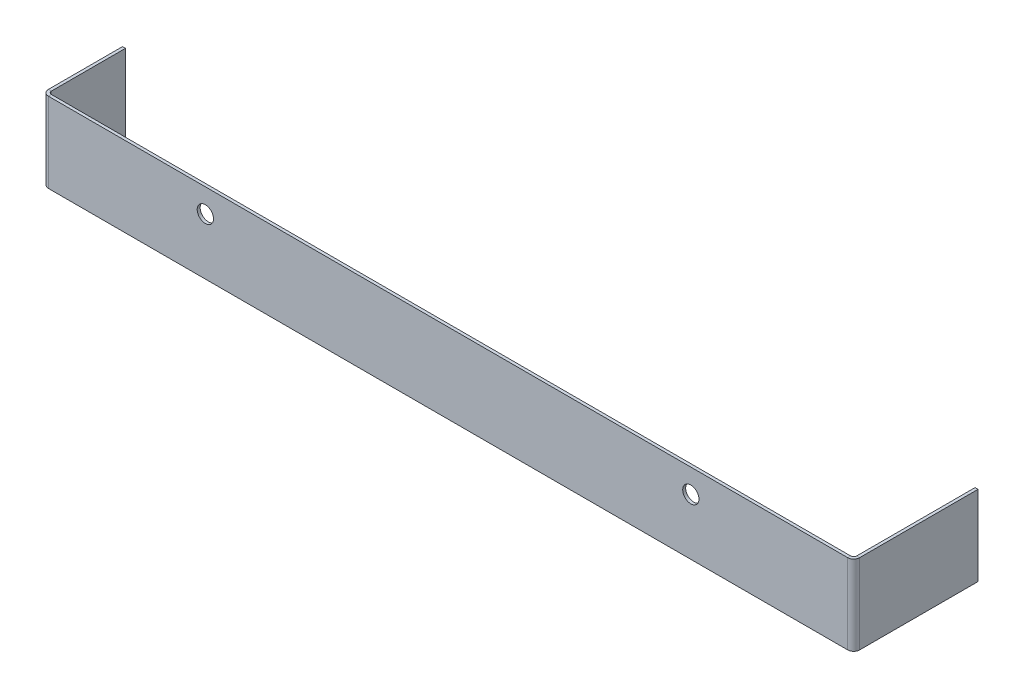
ISO-10303-21;
HEADER;
FILE_DESCRIPTION(('STEP AP214'),'2;1');
FILE_NAME('part.step','',(''),(''),'','','');
FILE_SCHEMA(('AUTOMOTIVE_DESIGN { 1 0 10303 214 1 1 1 1 }'));
ENDSEC;
DATA;
#1=APPLICATION_CONTEXT('core data for automotive mechanical design processes');
#2=APPLICATION_PROTOCOL_DEFINITION('international standard','automotive_design',2000,#1);
#3=PRODUCT_CONTEXT('',#1,'mechanical');
#4=PRODUCT('Part','Part','',(#3));
#5=PRODUCT_RELATED_PRODUCT_CATEGORY('part','',(#4));
#6=PRODUCT_DEFINITION_FORMATION('','',#4);
#7=PRODUCT_DEFINITION_CONTEXT('part definition',#1,'design');
#8=PRODUCT_DEFINITION('design','',#6,#7);
#9=PRODUCT_DEFINITION_SHAPE('','',#8);
#10=(LENGTH_UNIT() NAMED_UNIT(*) SI_UNIT(.MILLI.,.METRE.));
#11=(NAMED_UNIT(*) PLANE_ANGLE_UNIT() SI_UNIT($,.RADIAN.));
#12=(NAMED_UNIT(*) SI_UNIT($,.STERADIAN.) SOLID_ANGLE_UNIT());
#13=UNCERTAINTY_MEASURE_WITH_UNIT(LENGTH_MEASURE(1.E-05),#10,'distance_accuracy_value','');
#14=(GEOMETRIC_REPRESENTATION_CONTEXT(3) GLOBAL_UNCERTAINTY_ASSIGNED_CONTEXT((#13)) GLOBAL_UNIT_ASSIGNED_CONTEXT((#10,
#11,#12)) REPRESENTATION_CONTEXT('',''));
#15=CARTESIAN_POINT('',(0.,0.,0.));
#16=DIRECTION('',(0.,0.,1.));
#17=DIRECTION('',(1.,0.,0.));
#18=AXIS2_PLACEMENT_3D('',#15,#16,#17);
#19=CARTESIAN_POINT('',(-135.,-13.5,-1.));
#20=DIRECTION('',(0.,-1.,0.));
#21=DIRECTION('',(0.,0.,-1.));
#22=AXIS2_PLACEMENT_3D('',#19,#20,#21);
#23=PLANE('',#22);
#24=DIRECTION('',(1.,0.,0.));
#25=VECTOR('',#24,1.);
#26=CARTESIAN_POINT('',(-135.,-13.5,0.));
#27=LINE('',#26,#25);
#28=CARTESIAN_POINT('',(-135.,-13.5,0.));
#29=VERTEX_POINT('',#28);
#30=CARTESIAN_POINT('',(135.,-13.5,0.));
#31=VERTEX_POINT('',#30);
#32=EDGE_CURVE('E308',#29,#31,#27,.T.);
#33=ORIENTED_EDGE('',*,*,#32,.F.);
#34=DIRECTION('',(0.,0.,1.));
#35=VECTOR('',#34,1.);
#36=CARTESIAN_POINT('',(-135.,-13.5,-1.));
#37=LINE('',#36,#35);
#38=CARTESIAN_POINT('',(-135.,-13.5,-1.));
#39=VERTEX_POINT('',#38);
#40=EDGE_CURVE('E90',#39,#29,#37,.T.);
#41=ORIENTED_EDGE('',*,*,#40,.F.);
#42=DIRECTION('',(1.,0.,0.));
#43=VECTOR('',#42,1.);
#44=CARTESIAN_POINT('',(-135.,-13.5,-1.));
#45=LINE('',#44,#43);
#46=CARTESIAN_POINT('',(135.,-13.5,-1.));
#47=VERTEX_POINT('',#46);
#48=EDGE_CURVE('E315',#39,#47,#45,.T.);
#49=ORIENTED_EDGE('',*,*,#48,.T.);
#50=DIRECTION('',(0.,0.,1.));
#51=VECTOR('',#50,1.);
#52=CARTESIAN_POINT('',(135.,-13.5,-1.));
#53=LINE('',#52,#51);
#54=EDGE_CURVE('E13',#47,#31,#53,.T.);
#55=ORIENTED_EDGE('',*,*,#54,.T.);
#56=EDGE_LOOP('',(#33,#41,#49,#55));
#57=FACE_BOUND('',#56,.T.);
#58=ADVANCED_FACE('F80',(#57),#23,.T.);
#59=CARTESIAN_POINT('',(-135.,13.5,-1.));
#60=DIRECTION('',(0.,1.,0.));
#61=DIRECTION('',(0.,0.,1.));
#62=AXIS2_PLACEMENT_3D('',#59,#60,#61);
#63=PLANE('',#62);
#64=DIRECTION('',(-1.,0.,0.));
#65=VECTOR('',#64,1.);
#66=CARTESIAN_POINT('',(-135.,13.5,0.));
#67=LINE('',#66,#65);
#68=CARTESIAN_POINT('',(135.,13.5,0.));
#69=VERTEX_POINT('',#68);
#70=CARTESIAN_POINT('',(-135.,13.5,0.));
#71=VERTEX_POINT('',#70);
#72=EDGE_CURVE('E322',#69,#71,#67,.T.);
#73=ORIENTED_EDGE('',*,*,#72,.F.);
#74=DIRECTION('',(0.,0.,1.));
#75=VECTOR('',#74,1.);
#76=CARTESIAN_POINT('',(135.,13.5,-1.));
#77=LINE('',#76,#75);
#78=CARTESIAN_POINT('',(135.,13.5,-1.));
#79=VERTEX_POINT('',#78);
#80=EDGE_CURVE('E84',#79,#69,#77,.T.);
#81=ORIENTED_EDGE('',*,*,#80,.F.);
#82=DIRECTION('',(-1.,0.,0.));
#83=VECTOR('',#82,1.);
#84=CARTESIAN_POINT('',(-135.,13.5,-1.));
#85=LINE('',#84,#83);
#86=CARTESIAN_POINT('',(-135.,13.5,-1.));
#87=VERTEX_POINT('',#86);
#88=EDGE_CURVE('E307',#79,#87,#85,.T.);
#89=ORIENTED_EDGE('',*,*,#88,.T.);
#90=DIRECTION('',(0.,0.,1.));
#91=VECTOR('',#90,1.);
#92=CARTESIAN_POINT('',(-135.,13.5,-1.));
#93=LINE('',#92,#91);
#94=EDGE_CURVE('E332',#87,#71,#93,.T.);
#95=ORIENTED_EDGE('',*,*,#94,.T.);
#96=EDGE_LOOP('',(#73,#81,#89,#95));
#97=FACE_BOUND('',#96,.T.);
#98=ADVANCED_FACE('F82',(#97),#63,.T.);
#99=CARTESIAN_POINT('',(0.,0.,-1.));
#100=DIRECTION('',(0.,0.,-1.));
#101=DIRECTION('',(-1.,0.,0.));
#102=AXIS2_PLACEMENT_3D('',#99,#100,#101);
#103=PLANE('',#102);
#104=CARTESIAN_POINT('',(82.,5.50000000000072,-1.));
#105=DIRECTION('',(0.,0.,-1.));
#106=DIRECTION('',(-1.,0.,0.));
#107=AXIS2_PLACEMENT_3D('',#104,#105,#106);
#108=CIRCLE('',#107,2.75);
#109=CARTESIAN_POINT('',(79.25,5.50000000000072,-1.));
#110=VERTEX_POINT('',#109);
#111=EDGE_CURVE('E451',#110,#110,#108,.T.);
#112=ORIENTED_EDGE('',*,*,#111,.F.);
#113=EDGE_LOOP('',(#112));
#114=FACE_BOUND('',#113,.T.);
#115=CARTESIAN_POINT('',(-82.,5.50000000000072,-1.));
#116=DIRECTION('',(0.,0.,-1.));
#117=DIRECTION('',(-1.,0.,0.));
#118=AXIS2_PLACEMENT_3D('',#115,#116,#117);
#119=CIRCLE('',#118,2.75);
#120=CARTESIAN_POINT('',(-84.75,5.50000000000072,-1.));
#121=VERTEX_POINT('',#120);
#122=EDGE_CURVE('E238',#121,#121,#119,.T.);
#123=ORIENTED_EDGE('',*,*,#122,.F.);
#124=EDGE_LOOP('',(#123));
#125=FACE_BOUND('',#124,.T.);
#126=DIRECTION('',(0.,1.,0.));
#127=VECTOR('',#126,1.);
#128=CARTESIAN_POINT('',(135.,-13.5,-1.));
#129=LINE('',#128,#127);
#130=EDGE_CURVE('E304',#47,#79,#129,.T.);
#131=ORIENTED_EDGE('',*,*,#130,.F.);
#132=ORIENTED_EDGE('',*,*,#48,.F.);
#133=DIRECTION('',(0.,-1.,0.));
#134=VECTOR('',#133,1.);
#135=CARTESIAN_POINT('',(-135.,-13.5,-1.));
#136=LINE('',#135,#134);
#137=EDGE_CURVE('E312',#87,#39,#136,.T.);
#138=ORIENTED_EDGE('',*,*,#137,.F.);
#139=ORIENTED_EDGE('',*,*,#88,.F.);
#140=EDGE_LOOP('',(#131,#132,#138,#139));
#141=FACE_BOUND('',#140,.T.);
#142=ADVANCED_FACE('F355',(#114,#125,#141),#103,.T.);
#143=CARTESIAN_POINT('',(0.,0.,0.));
#144=DIRECTION('',(0.,0.,-1.));
#145=DIRECTION('',(-1.,0.,0.));
#146=AXIS2_PLACEMENT_3D('',#143,#144,#145);
#147=PLANE('',#146);
#148=CARTESIAN_POINT('',(82.,5.50000000000072,0.));
#149=DIRECTION('',(0.,0.,1.));
#150=DIRECTION('',(1.,0.,0.));
#151=AXIS2_PLACEMENT_3D('',#148,#149,#150);
#152=CIRCLE('',#151,2.75);
#153=CARTESIAN_POINT('',(84.75,5.50000000000072,0.));
#154=VERTEX_POINT('',#153);
#155=EDGE_CURVE('E454',#154,#154,#152,.T.);
#156=ORIENTED_EDGE('',*,*,#155,.F.);
#157=EDGE_LOOP('',(#156));
#158=FACE_BOUND('',#157,.T.);
#159=CARTESIAN_POINT('',(-82.,5.50000000000072,0.));
#160=DIRECTION('',(0.,0.,1.));
#161=DIRECTION('',(1.,0.,0.));
#162=AXIS2_PLACEMENT_3D('',#159,#160,#161);
#163=CIRCLE('',#162,2.75);
#164=CARTESIAN_POINT('',(-79.25,5.50000000000072,0.));
#165=VERTEX_POINT('',#164);
#166=EDGE_CURVE('E458',#165,#165,#163,.T.);
#167=ORIENTED_EDGE('',*,*,#166,.F.);
#168=EDGE_LOOP('',(#167));
#169=FACE_BOUND('',#168,.T.);
#170=DIRECTION('',(0.,1.,0.));
#171=VECTOR('',#170,1.);
#172=CARTESIAN_POINT('',(135.,-13.5,0.));
#173=LINE('',#172,#171);
#174=EDGE_CURVE('E292',#31,#69,#173,.T.);
#175=ORIENTED_EDGE('',*,*,#174,.T.);
#176=ORIENTED_EDGE('',*,*,#72,.T.);
#177=DIRECTION('',(0.,-1.,0.));
#178=VECTOR('',#177,1.);
#179=CARTESIAN_POINT('',(-135.,-13.5,0.));
#180=LINE('',#179,#178);
#181=EDGE_CURVE('E176',#71,#29,#180,.T.);
#182=ORIENTED_EDGE('',*,*,#181,.T.);
#183=ORIENTED_EDGE('',*,*,#32,.T.);
#184=EDGE_LOOP('',(#175,#176,#182,#183));
#185=FACE_BOUND('',#184,.T.);
#186=ADVANCED_FACE('F342',(#158,#169,#185),#147,.F.);
#187=CARTESIAN_POINT('',(135.,13.5,-2.00000000000001));
#188=DIRECTION('',(0.,1.,0.));
#189=DIRECTION('',(0.,0.,1.));
#190=AXIS2_PLACEMENT_3D('',#187,#188,#189);
#191=PLANE('',#190);
#192=DIRECTION('',(1.,0.,0.));
#193=VECTOR('',#192,1.);
#194=CARTESIAN_POINT('',(137.,13.5,-2.));
#195=LINE('',#194,#193);
#196=CARTESIAN_POINT('',(136.,13.5,-2.));
#197=VERTEX_POINT('',#196);
#198=CARTESIAN_POINT('',(137.,13.5,-2.));
#199=VERTEX_POINT('',#198);
#200=EDGE_CURVE('E240',#197,#199,#195,.T.);
#201=ORIENTED_EDGE('',*,*,#200,.F.);
#202=CARTESIAN_POINT('',(135.,13.5,-2.00000000000001));
#203=DIRECTION('',(0.,-1.,0.));
#204=DIRECTION('',(0.,0.,-1.));
#205=AXIS2_PLACEMENT_3D('',#202,#203,#204);
#206=CIRCLE('',#205,1.);
#207=EDGE_CURVE('E297',#79,#197,#206,.F.);
#208=ORIENTED_EDGE('',*,*,#207,.F.);
#209=ORIENTED_EDGE('',*,*,#80,.T.);
#210=CARTESIAN_POINT('',(135.,13.5,-2.00000000000001));
#211=DIRECTION('',(0.,-1.,0.));
#212=DIRECTION('',(0.,0.,-1.));
#213=AXIS2_PLACEMENT_3D('',#210,#211,#212);
#214=CIRCLE('',#213,2.);
#215=EDGE_CURVE('E106',#69,#199,#214,.F.);
#216=ORIENTED_EDGE('',*,*,#215,.T.);
#217=EDGE_LOOP('',(#201,#208,#209,#216));
#218=FACE_BOUND('',#217,.T.);
#219=ADVANCED_FACE('F339',(#218),#191,.T.);
#220=CARTESIAN_POINT('',(135.,-13.5,-2.00000000000001));
#221=DIRECTION('',(0.,1.,0.));
#222=DIRECTION('',(0.,0.,1.));
#223=AXIS2_PLACEMENT_3D('',#220,#221,#222);
#224=PLANE('',#223);
#225=CARTESIAN_POINT('',(135.,-13.5,-2.00000000000001));
#226=DIRECTION('',(0.,-1.,0.));
#227=DIRECTION('',(0.,0.,-1.));
#228=AXIS2_PLACEMENT_3D('',#225,#226,#227);
#229=CIRCLE('',#228,1.);
#230=CARTESIAN_POINT('',(136.,-13.5,-2.));
#231=VERTEX_POINT('',#230);
#232=EDGE_CURVE('E250',#231,#47,#229,.T.);
#233=ORIENTED_EDGE('',*,*,#232,.F.);
#234=DIRECTION('',(1.,0.,0.));
#235=VECTOR('',#234,1.);
#236=CARTESIAN_POINT('',(136.,-13.5,-2.));
#237=LINE('',#236,#235);
#238=CARTESIAN_POINT('',(137.,-13.5,-2.));
#239=VERTEX_POINT('',#238);
#240=EDGE_CURVE('E280',#231,#239,#237,.T.);
#241=ORIENTED_EDGE('',*,*,#240,.T.);
#242=CARTESIAN_POINT('',(135.,-13.5,-2.00000000000001));
#243=DIRECTION('',(0.,-1.,0.));
#244=DIRECTION('',(0.,0.,-1.));
#245=AXIS2_PLACEMENT_3D('',#242,#243,#244);
#246=CIRCLE('',#245,2.);
#247=EDGE_CURVE('E293',#239,#31,#246,.T.);
#248=ORIENTED_EDGE('',*,*,#247,.T.);
#249=ORIENTED_EDGE('',*,*,#54,.F.);
#250=EDGE_LOOP('',(#233,#241,#248,#249));
#251=FACE_BOUND('',#250,.T.);
#252=ADVANCED_FACE('F347',(#251),#224,.F.);
#253=CARTESIAN_POINT('',(135.,-13.5,-2.00000000000001));
#254=DIRECTION('',(0.,-1.,0.));
#255=DIRECTION('',(1.,0.,0.));
#256=AXIS2_PLACEMENT_3D('',#253,#254,#255);
#257=CYLINDRICAL_SURFACE('',#256,2.);
#258=ORIENTED_EDGE('',*,*,#174,.F.);
#259=ORIENTED_EDGE('',*,*,#247,.F.);
#260=DIRECTION('',(0.,-1.,0.));
#261=VECTOR('',#260,1.);
#262=CARTESIAN_POINT('',(137.,0.,-2.));
#263=LINE('',#262,#261);
#264=EDGE_CURVE('E276',#199,#239,#263,.T.);
#265=ORIENTED_EDGE('',*,*,#264,.F.);
#266=ORIENTED_EDGE('',*,*,#215,.F.);
#267=EDGE_LOOP('',(#258,#259,#265,#266));
#268=FACE_BOUND('',#267,.T.);
#269=ADVANCED_FACE('F344',(#268),#257,.T.);
#270=CARTESIAN_POINT('',(135.,-13.5,-2.00000000000001));
#271=DIRECTION('',(0.,-1.,0.));
#272=DIRECTION('',(1.,0.,0.));
#273=AXIS2_PLACEMENT_3D('',#270,#271,#272);
#274=CYLINDRICAL_SURFACE('',#273,1.);
#275=ORIENTED_EDGE('',*,*,#130,.T.);
#276=ORIENTED_EDGE('',*,*,#207,.T.);
#277=DIRECTION('',(0.,1.,0.));
#278=VECTOR('',#277,1.);
#279=CARTESIAN_POINT('',(136.,13.5,-2.));
#280=LINE('',#279,#278);
#281=EDGE_CURVE('E284',#197,#231,#280,.F.);
#282=ORIENTED_EDGE('',*,*,#281,.T.);
#283=ORIENTED_EDGE('',*,*,#232,.T.);
#284=EDGE_LOOP('',(#275,#276,#282,#283));
#285=FACE_BOUND('',#284,.T.);
#286=ADVANCED_FACE('F357',(#285),#274,.F.);
#287=CARTESIAN_POINT('',(137.,-13.5,-0.999999999999997));
#288=DIRECTION('',(0.,-1.,0.));
#289=DIRECTION('',(0.,0.,-1.));
#290=AXIS2_PLACEMENT_3D('',#287,#288,#289);
#291=PLANE('',#290);
#292=DIRECTION('',(0.,0.,1.));
#293=VECTOR('',#292,1.);
#294=CARTESIAN_POINT('',(137.,-13.5,-0.999999999999997));
#295=LINE('',#294,#293);
#296=CARTESIAN_POINT('',(137.,-13.5,-42.));
#297=VERTEX_POINT('',#296);
#298=EDGE_CURVE('E255',#297,#239,#295,.T.);
#299=ORIENTED_EDGE('',*,*,#298,.T.);
#300=ORIENTED_EDGE('',*,*,#240,.F.);
#301=DIRECTION('',(0.,0.,-1.));
#302=VECTOR('',#301,1.);
#303=CARTESIAN_POINT('',(136.,-13.5,4.56951549769501E-13));
#304=LINE('',#303,#302);
#305=CARTESIAN_POINT('',(136.,-13.5,-42.));
#306=VERTEX_POINT('',#305);
#307=EDGE_CURVE('E265',#306,#231,#304,.F.);
#308=ORIENTED_EDGE('',*,*,#307,.F.);
#309=DIRECTION('',(-1.,0.,0.));
#310=VECTOR('',#309,1.);
#311=CARTESIAN_POINT('',(137.,-13.5,-42.));
#312=LINE('',#311,#310);
#313=EDGE_CURVE('E247',#297,#306,#312,.T.);
#314=ORIENTED_EDGE('',*,*,#313,.F.);
#315=EDGE_LOOP('',(#299,#300,#308,#314));
#316=FACE_BOUND('',#315,.T.);
#317=ADVANCED_FACE('F365',(#316),#291,.T.);
#318=CARTESIAN_POINT('',(137.,13.5,-42.));
#319=DIRECTION('',(0.,1.,0.));
#320=DIRECTION('',(0.,0.,1.));
#321=AXIS2_PLACEMENT_3D('',#318,#319,#320);
#322=PLANE('',#321);
#323=DIRECTION('',(0.,0.,1.));
#324=VECTOR('',#323,1.);
#325=CARTESIAN_POINT('',(136.,13.5,4.56951549769501E-13));
#326=LINE('',#325,#324);
#327=CARTESIAN_POINT('',(136.,13.5,-42.));
#328=VERTEX_POINT('',#327);
#329=EDGE_CURVE('E273',#197,#328,#326,.F.);
#330=ORIENTED_EDGE('',*,*,#329,.F.);
#331=ORIENTED_EDGE('',*,*,#200,.T.);
#332=DIRECTION('',(0.,0.,-1.));
#333=VECTOR('',#332,1.);
#334=CARTESIAN_POINT('',(137.,13.5,-42.));
#335=LINE('',#334,#333);
#336=CARTESIAN_POINT('',(137.,13.5,-42.));
#337=VERTEX_POINT('',#336);
#338=EDGE_CURVE('E262',#199,#337,#335,.T.);
#339=ORIENTED_EDGE('',*,*,#338,.T.);
#340=DIRECTION('',(-1.,0.,0.));
#341=VECTOR('',#340,1.);
#342=CARTESIAN_POINT('',(137.,13.5,-42.));
#343=LINE('',#342,#341);
#344=EDGE_CURVE('E251',#337,#328,#343,.T.);
#345=ORIENTED_EDGE('',*,*,#344,.T.);
#346=EDGE_LOOP('',(#330,#331,#339,#345));
#347=FACE_BOUND('',#346,.T.);
#348=ADVANCED_FACE('F373',(#347),#322,.T.);
#349=CARTESIAN_POINT('',(137.,0.,4.60443031108344E-13));
#350=DIRECTION('',(1.,0.,0.));
#351=DIRECTION('',(0.,0.,-1.));
#352=AXIS2_PLACEMENT_3D('',#349,#350,#351);
#353=PLANE('',#352);
#354=ORIENTED_EDGE('',*,*,#338,.F.);
#355=ORIENTED_EDGE('',*,*,#264,.T.);
#356=ORIENTED_EDGE('',*,*,#298,.F.);
#357=DIRECTION('',(0.,-1.,0.));
#358=VECTOR('',#357,1.);
#359=CARTESIAN_POINT('',(137.,-13.5,-42.));
#360=LINE('',#359,#358);
#361=EDGE_CURVE('E258',#337,#297,#360,.T.);
#362=ORIENTED_EDGE('',*,*,#361,.F.);
#363=EDGE_LOOP('',(#354,#355,#356,#362));
#364=FACE_BOUND('',#363,.T.);
#365=ADVANCED_FACE('F370',(#364),#353,.T.);
#366=CARTESIAN_POINT('',(136.,0.,4.56951549769501E-13));
#367=DIRECTION('',(1.,0.,0.));
#368=DIRECTION('',(0.,0.,-1.));
#369=AXIS2_PLACEMENT_3D('',#366,#367,#368);
#370=PLANE('',#369);
#371=ORIENTED_EDGE('',*,*,#281,.F.);
#372=ORIENTED_EDGE('',*,*,#329,.T.);
#373=DIRECTION('',(0.,1.,0.));
#374=VECTOR('',#373,1.);
#375=CARTESIAN_POINT('',(136.,0.,-42.));
#376=LINE('',#375,#374);
#377=EDGE_CURVE('E269',#328,#306,#376,.F.);
#378=ORIENTED_EDGE('',*,*,#377,.T.);
#379=ORIENTED_EDGE('',*,*,#307,.T.);
#380=EDGE_LOOP('',(#371,#372,#378,#379));
#381=FACE_BOUND('',#380,.T.);
#382=ADVANCED_FACE('F361',(#381),#370,.F.);
#383=CARTESIAN_POINT('',(137.,-13.5,-42.));
#384=DIRECTION('',(0.,0.,-1.));
#385=DIRECTION('',(-1.,0.,0.));
#386=AXIS2_PLACEMENT_3D('',#383,#384,#385);
#387=PLANE('',#386);
#388=ORIENTED_EDGE('',*,*,#377,.F.);
#389=ORIENTED_EDGE('',*,*,#344,.F.);
#390=ORIENTED_EDGE('',*,*,#361,.T.);
#391=ORIENTED_EDGE('',*,*,#313,.T.);
#392=EDGE_LOOP('',(#388,#389,#390,#391));
#393=FACE_BOUND('',#392,.T.);
#394=ADVANCED_FACE('F375',(#393),#387,.T.);
#395=CARTESIAN_POINT('',(-135.,-13.5,-2.));
#396=DIRECTION('',(0.,-1.,0.));
#397=DIRECTION('',(0.,0.,-1.));
#398=AXIS2_PLACEMENT_3D('',#395,#396,#397);
#399=PLANE('',#398);
#400=DIRECTION('',(-1.,0.,0.));
#401=VECTOR('',#400,1.);
#402=CARTESIAN_POINT('',(-137.,-13.5,-2.));
#403=LINE('',#402,#401);
#404=CARTESIAN_POINT('',(-136.,-13.5,-2.));
#405=VERTEX_POINT('',#404);
#406=CARTESIAN_POINT('',(-137.,-13.5,-2.));
#407=VERTEX_POINT('',#406);
#408=EDGE_CURVE('E234',#405,#407,#403,.T.);
#409=ORIENTED_EDGE('',*,*,#408,.F.);
#410=CARTESIAN_POINT('',(-135.,-13.5,-2.));
#411=DIRECTION('',(0.,1.,0.));
#412=DIRECTION('',(0.,0.,1.));
#413=AXIS2_PLACEMENT_3D('',#410,#411,#412);
#414=CIRCLE('',#413,1.);
#415=EDGE_CURVE('E180',#39,#405,#414,.F.);
#416=ORIENTED_EDGE('',*,*,#415,.F.);
#417=ORIENTED_EDGE('',*,*,#40,.T.);
#418=CARTESIAN_POINT('',(-135.,-13.5,-2.));
#419=DIRECTION('',(0.,1.,0.));
#420=DIRECTION('',(0.,0.,1.));
#421=AXIS2_PLACEMENT_3D('',#418,#419,#420);
#422=CIRCLE('',#421,2.);
#423=EDGE_CURVE('E98',#29,#407,#422,.F.);
#424=ORIENTED_EDGE('',*,*,#423,.T.);
#425=EDGE_LOOP('',(#409,#416,#417,#424));
#426=FACE_BOUND('',#425,.T.);
#427=ADVANCED_FACE('F377',(#426),#399,.T.);
#428=CARTESIAN_POINT('',(-135.,13.5,-2.));
#429=DIRECTION('',(0.,-1.,0.));
#430=DIRECTION('',(0.,0.,-1.));
#431=AXIS2_PLACEMENT_3D('',#428,#429,#430);
#432=PLANE('',#431);
#433=CARTESIAN_POINT('',(-135.,13.5,-2.));
#434=DIRECTION('',(0.,1.,0.));
#435=DIRECTION('',(0.,0.,1.));
#436=AXIS2_PLACEMENT_3D('',#433,#434,#435);
#437=CIRCLE('',#436,1.);
#438=CARTESIAN_POINT('',(-136.,13.5,-2.));
#439=VERTEX_POINT('',#438);
#440=EDGE_CURVE('E187',#439,#87,#437,.T.);
#441=ORIENTED_EDGE('',*,*,#440,.F.);
#442=DIRECTION('',(-1.,0.,0.));
#443=VECTOR('',#442,1.);
#444=CARTESIAN_POINT('',(-136.,13.5,-2.));
#445=LINE('',#444,#443);
#446=CARTESIAN_POINT('',(-137.,13.5,-2.));
#447=VERTEX_POINT('',#446);
#448=EDGE_CURVE('E184',#439,#447,#445,.T.);
#449=ORIENTED_EDGE('',*,*,#448,.T.);
#450=CARTESIAN_POINT('',(-135.,13.5,-2.));
#451=DIRECTION('',(0.,1.,0.));
#452=DIRECTION('',(0.,0.,1.));
#453=AXIS2_PLACEMENT_3D('',#450,#451,#452);
#454=CIRCLE('',#453,2.);
#455=EDGE_CURVE('E170',#447,#71,#454,.T.);
#456=ORIENTED_EDGE('',*,*,#455,.T.);
#457=ORIENTED_EDGE('',*,*,#94,.F.);
#458=EDGE_LOOP('',(#441,#449,#456,#457));
#459=FACE_BOUND('',#458,.T.);
#460=ADVANCED_FACE('F185',(#459),#432,.F.);
#461=CARTESIAN_POINT('',(-135.,13.5,-2.));
#462=DIRECTION('',(0.,1.,0.));
#463=DIRECTION('',(-1.,0.,0.));
#464=AXIS2_PLACEMENT_3D('',#461,#462,#463);
#465=CYLINDRICAL_SURFACE('',#464,2.);
#466=ORIENTED_EDGE('',*,*,#181,.F.);
#467=ORIENTED_EDGE('',*,*,#455,.F.);
#468=DIRECTION('',(0.,1.,0.));
#469=VECTOR('',#468,1.);
#470=CARTESIAN_POINT('',(-137.,0.,-2.));
#471=LINE('',#470,#469);
#472=EDGE_CURVE('E174',#407,#447,#471,.T.);
#473=ORIENTED_EDGE('',*,*,#472,.F.);
#474=ORIENTED_EDGE('',*,*,#423,.F.);
#475=EDGE_LOOP('',(#466,#467,#473,#474));
#476=FACE_BOUND('',#475,.T.);
#477=ADVANCED_FACE('F172',(#476),#465,.T.);
#478=CARTESIAN_POINT('',(-135.,13.5,-2.));
#479=DIRECTION('',(0.,1.,0.));
#480=DIRECTION('',(-1.,0.,0.));
#481=AXIS2_PLACEMENT_3D('',#478,#479,#480);
#482=CYLINDRICAL_SURFACE('',#481,1.);
#483=ORIENTED_EDGE('',*,*,#137,.T.);
#484=ORIENTED_EDGE('',*,*,#415,.T.);
#485=DIRECTION('',(0.,-1.,0.));
#486=VECTOR('',#485,1.);
#487=CARTESIAN_POINT('',(-136.,-13.5,-2.));
#488=LINE('',#487,#486);
#489=EDGE_CURVE('E193',#405,#439,#488,.F.);
#490=ORIENTED_EDGE('',*,*,#489,.T.);
#491=ORIENTED_EDGE('',*,*,#440,.T.);
#492=EDGE_LOOP('',(#483,#484,#490,#491));
#493=FACE_BOUND('',#492,.T.);
#494=ADVANCED_FACE('F417',(#493),#482,.F.);
#495=CARTESIAN_POINT('',(-137.,13.5,-0.999999999999997));
#496=DIRECTION('',(0.,1.,0.));
#497=DIRECTION('',(0.,0.,1.));
#498=AXIS2_PLACEMENT_3D('',#495,#496,#497);
#499=PLANE('',#498);
#500=DIRECTION('',(0.,0.,1.));
#501=VECTOR('',#500,1.);
#502=CARTESIAN_POINT('',(-137.,13.5,-0.999999999999997));
#503=LINE('',#502,#501);
#504=CARTESIAN_POINT('',(-137.,13.5,-27.));
#505=VERTEX_POINT('',#504);
#506=EDGE_CURVE('E200',#505,#447,#503,.T.);
#507=ORIENTED_EDGE('',*,*,#506,.T.);
#508=ORIENTED_EDGE('',*,*,#448,.F.);
#509=DIRECTION('',(0.,0.,-1.));
#510=VECTOR('',#509,1.);
#511=CARTESIAN_POINT('',(-136.,13.5,4.32346466320373E-13));
#512=LINE('',#511,#510);
#513=CARTESIAN_POINT('',(-136.,13.5,-27.));
#514=VERTEX_POINT('',#513);
#515=EDGE_CURVE('E223',#514,#439,#512,.F.);
#516=ORIENTED_EDGE('',*,*,#515,.F.);
#517=DIRECTION('',(1.,0.,0.));
#518=VECTOR('',#517,1.);
#519=CARTESIAN_POINT('',(-137.,13.5,-27.));
#520=LINE('',#519,#518);
#521=EDGE_CURVE('E206',#505,#514,#520,.T.);
#522=ORIENTED_EDGE('',*,*,#521,.F.);
#523=EDGE_LOOP('',(#507,#508,#516,#522));
#524=FACE_BOUND('',#523,.T.);
#525=ADVANCED_FACE('F205',(#524),#499,.T.);
#526=CARTESIAN_POINT('',(-137.,-13.5,-27.));
#527=DIRECTION('',(0.,-1.,0.));
#528=DIRECTION('',(0.,0.,-1.));
#529=AXIS2_PLACEMENT_3D('',#526,#527,#528);
#530=PLANE('',#529);
#531=DIRECTION('',(0.,0.,1.));
#532=VECTOR('',#531,1.);
#533=CARTESIAN_POINT('',(-136.,-13.5,4.32346466320373E-13));
#534=LINE('',#533,#532);
#535=CARTESIAN_POINT('',(-136.,-13.5,-27.));
#536=VERTEX_POINT('',#535);
#537=EDGE_CURVE('E203',#405,#536,#534,.F.);
#538=ORIENTED_EDGE('',*,*,#537,.F.);
#539=ORIENTED_EDGE('',*,*,#408,.T.);
#540=DIRECTION('',(0.,0.,-1.));
#541=VECTOR('',#540,1.);
#542=CARTESIAN_POINT('',(-137.,-13.5,-27.));
#543=LINE('',#542,#541);
#544=CARTESIAN_POINT('',(-137.,-13.5,-27.));
#545=VERTEX_POINT('',#544);
#546=EDGE_CURVE('E201',#407,#545,#543,.T.);
#547=ORIENTED_EDGE('',*,*,#546,.T.);
#548=DIRECTION('',(1.,0.,0.));
#549=VECTOR('',#548,1.);
#550=CARTESIAN_POINT('',(-137.,-13.5,-27.));
#551=LINE('',#550,#549);
#552=EDGE_CURVE('E209',#545,#536,#551,.T.);
#553=ORIENTED_EDGE('',*,*,#552,.T.);
#554=EDGE_LOOP('',(#538,#539,#547,#553));
#555=FACE_BOUND('',#554,.T.);
#556=ADVANCED_FACE('F423',(#555),#530,.T.);
#557=CARTESIAN_POINT('',(-137.,0.,4.35837947659217E-13));
#558=DIRECTION('',(-1.,0.,0.));
#559=DIRECTION('',(0.,0.,1.));
#560=AXIS2_PLACEMENT_3D('',#557,#558,#559);
#561=PLANE('',#560);
#562=ORIENTED_EDGE('',*,*,#546,.F.);
#563=ORIENTED_EDGE('',*,*,#472,.T.);
#564=ORIENTED_EDGE('',*,*,#506,.F.);
#565=DIRECTION('',(0.,1.,0.));
#566=VECTOR('',#565,1.);
#567=CARTESIAN_POINT('',(-137.,13.5,-27.));
#568=LINE('',#567,#566);
#569=EDGE_CURVE('E210',#545,#505,#568,.T.);
#570=ORIENTED_EDGE('',*,*,#569,.F.);
#571=EDGE_LOOP('',(#562,#563,#564,#570));
#572=FACE_BOUND('',#571,.T.);
#573=ADVANCED_FACE('F198',(#572),#561,.T.);
#574=CARTESIAN_POINT('',(-136.,0.,4.32346466320373E-13));
#575=DIRECTION('',(-1.,0.,0.));
#576=DIRECTION('',(0.,0.,1.));
#577=AXIS2_PLACEMENT_3D('',#574,#575,#576);
#578=PLANE('',#577);
#579=ORIENTED_EDGE('',*,*,#489,.F.);
#580=ORIENTED_EDGE('',*,*,#537,.T.);
#581=DIRECTION('',(0.,-1.,0.));
#582=VECTOR('',#581,1.);
#583=CARTESIAN_POINT('',(-136.,0.,-27.));
#584=LINE('',#583,#582);
#585=EDGE_CURVE('E226',#536,#514,#584,.F.);
#586=ORIENTED_EDGE('',*,*,#585,.T.);
#587=ORIENTED_EDGE('',*,*,#515,.T.);
#588=EDGE_LOOP('',(#579,#580,#586,#587));
#589=FACE_BOUND('',#588,.T.);
#590=ADVANCED_FACE('F431',(#589),#578,.F.);
#591=CARTESIAN_POINT('',(-137.,13.5,-27.));
#592=DIRECTION('',(0.,0.,-1.));
#593=DIRECTION('',(-1.,0.,0.));
#594=AXIS2_PLACEMENT_3D('',#591,#592,#593);
#595=PLANE('',#594);
#596=ORIENTED_EDGE('',*,*,#585,.F.);
#597=ORIENTED_EDGE('',*,*,#552,.F.);
#598=ORIENTED_EDGE('',*,*,#569,.T.);
#599=ORIENTED_EDGE('',*,*,#521,.T.);
#600=EDGE_LOOP('',(#596,#597,#598,#599));
#601=FACE_BOUND('',#600,.T.);
#602=ADVANCED_FACE('F427',(#601),#595,.T.);
#603=CARTESIAN_POINT('',(-82.,5.50000000000072,0.));
#604=DIRECTION('',(0.,0.,1.));
#605=DIRECTION('',(1.,0.,0.));
#606=AXIS2_PLACEMENT_3D('',#603,#604,#605);
#607=CYLINDRICAL_SURFACE('',#606,2.75);
#608=ORIENTED_EDGE('',*,*,#122,.T.);
#609=EDGE_LOOP('',(#608));
#610=FACE_BOUND('',#609,.T.);
#611=ORIENTED_EDGE('',*,*,#166,.T.);
#612=EDGE_LOOP('',(#611));
#613=FACE_BOUND('',#612,.T.);
#614=ADVANCED_FACE('F430',(#610,#613),#607,.F.);
#615=CARTESIAN_POINT('',(82.,5.50000000000072,0.));
#616=DIRECTION('',(0.,0.,1.));
#617=DIRECTION('',(1.,0.,0.));
#618=AXIS2_PLACEMENT_3D('',#615,#616,#617);
#619=CYLINDRICAL_SURFACE('',#618,2.75);
#620=ORIENTED_EDGE('',*,*,#111,.T.);
#621=EDGE_LOOP('',(#620));
#622=FACE_BOUND('',#621,.T.);
#623=ORIENTED_EDGE('',*,*,#155,.T.);
#624=EDGE_LOOP('',(#623));
#625=FACE_BOUND('',#624,.T.);
#626=ADVANCED_FACE('F442',(#622,#625),#619,.F.);
#627=CLOSED_SHELL('',(#58,#98,#142,#186,#219,#252,#269,#286,#317,#348,#365,#382,#394,#427,#460,
#477,#494,#525,#556,#573,#590,#602,#614,#626));
#628=MANIFOLD_SOLID_BREP('B2',#627);
#629=ADVANCED_BREP_SHAPE_REPRESENTATION('',(#18,#628),#14);
#630=SHAPE_DEFINITION_REPRESENTATION(#9,#629);
ENDSEC;
END-ISO-10303-21;
